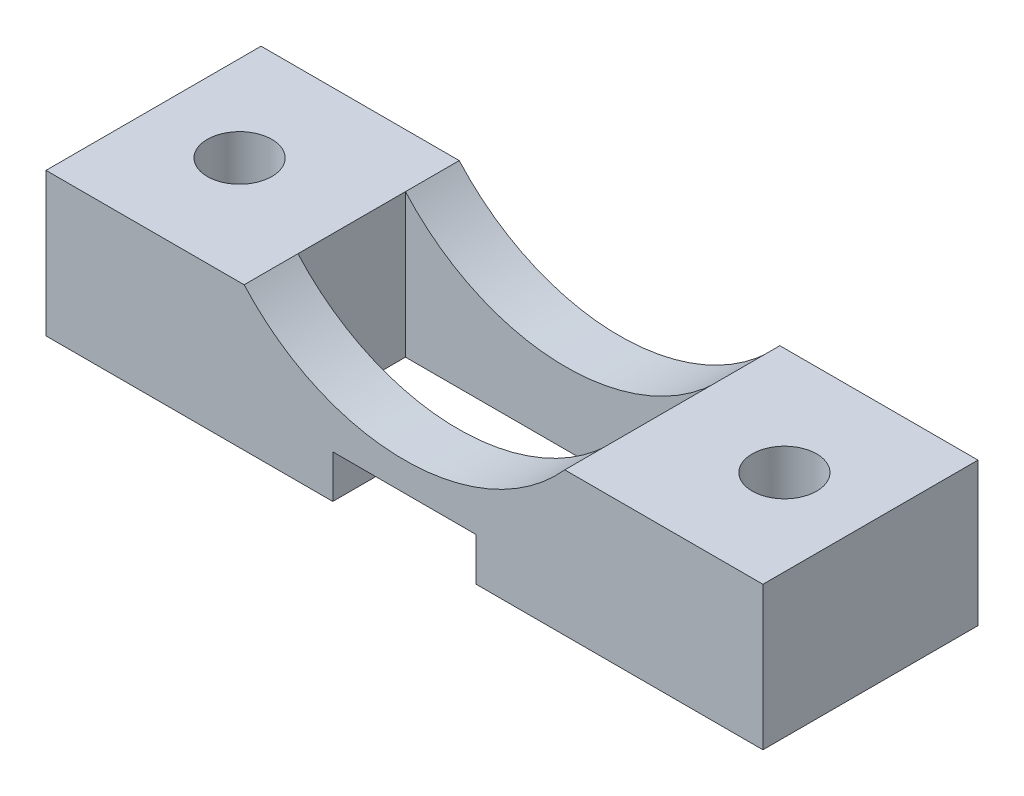
ISO-10303-21;
HEADER;
FILE_DESCRIPTION(('STEP AP214'),'2;1');
FILE_NAME('part.step','',(''),(''),'','','');
FILE_SCHEMA(('AUTOMOTIVE_DESIGN { 1 0 10303 214 1 1 1 1 }'));
ENDSEC;
DATA;
#1=APPLICATION_CONTEXT('core data for automotive mechanical design processes');
#2=APPLICATION_PROTOCOL_DEFINITION('international standard','automotive_design',2000,#1);
#3=PRODUCT_CONTEXT('',#1,'mechanical');
#4=PRODUCT('Part','Part','',(#3));
#5=PRODUCT_RELATED_PRODUCT_CATEGORY('part','',(#4));
#6=PRODUCT_DEFINITION_FORMATION('','',#4);
#7=PRODUCT_DEFINITION_CONTEXT('part definition',#1,'design');
#8=PRODUCT_DEFINITION('design','',#6,#7);
#9=PRODUCT_DEFINITION_SHAPE('','',#8);
#10=(LENGTH_UNIT() NAMED_UNIT(*) SI_UNIT(.MILLI.,.METRE.));
#11=(NAMED_UNIT(*) PLANE_ANGLE_UNIT() SI_UNIT($,.RADIAN.));
#12=(NAMED_UNIT(*) SI_UNIT($,.STERADIAN.) SOLID_ANGLE_UNIT());
#13=UNCERTAINTY_MEASURE_WITH_UNIT(LENGTH_MEASURE(1.E-05),#10,'distance_accuracy_value','');
#14=(GEOMETRIC_REPRESENTATION_CONTEXT(3) GLOBAL_UNCERTAINTY_ASSIGNED_CONTEXT((#13)) GLOBAL_UNIT_ASSIGNED_CONTEXT((#10,
#11,#12)) REPRESENTATION_CONTEXT('',''));
#15=CARTESIAN_POINT('',(0.,0.,0.));
#16=DIRECTION('',(0.,0.,1.));
#17=DIRECTION('',(1.,0.,0.));
#18=AXIS2_PLACEMENT_3D('',#15,#16,#17);
#19=CARTESIAN_POINT('',(0.,15.,15.));
#20=DIRECTION('',(0.,0.,-1.));
#21=DIRECTION('',(-1.,0.,0.));
#22=AXIS2_PLACEMENT_3D('',#19,#20,#21);
#23=CYLINDRICAL_SURFACE('',#22,15.);
#24=DIRECTION('',(0.,0.,-1.));
#25=VECTOR('',#24,1.);
#26=CARTESIAN_POINT('',(-11.180339887499,5.,15.));
#27=LINE('',#26,#25);
#28=CARTESIAN_POINT('',(-11.180339887499,5.,3.75));
#29=VERTEX_POINT('',#28);
#30=CARTESIAN_POINT('',(-11.180339887499,5.,0.));
#31=VERTEX_POINT('',#30);
#32=EDGE_CURVE('E393',#29,#31,#27,.T.);
#33=ORIENTED_EDGE('',*,*,#32,.F.);
#34=CARTESIAN_POINT('',(0.,15.,3.75));
#35=DIRECTION('',(0.,0.,-1.));
#36=DIRECTION('',(-1.,0.,0.));
#37=AXIS2_PLACEMENT_3D('',#34,#35,#36);
#38=CIRCLE('',#37,15.);
#39=CARTESIAN_POINT('',(11.1803398874989,5.,3.75));
#40=VERTEX_POINT('',#39);
#41=EDGE_CURVE('E183',#40,#29,#38,.T.);
#42=ORIENTED_EDGE('',*,*,#41,.F.);
#43=DIRECTION('',(0.,0.,-1.));
#44=VECTOR('',#43,1.);
#45=CARTESIAN_POINT('',(11.1803398874989,5.,15.));
#46=LINE('',#45,#44);
#47=CARTESIAN_POINT('',(11.1803398874989,5.,0.));
#48=VERTEX_POINT('',#47);
#49=EDGE_CURVE('E398',#40,#48,#46,.T.);
#50=ORIENTED_EDGE('',*,*,#49,.T.);
#51=CARTESIAN_POINT('',(0.,15.,0.));
#52=DIRECTION('',(0.,0.,-1.));
#53=DIRECTION('',(1.,0.,0.));
#54=AXIS2_PLACEMENT_3D('',#51,#52,#53);
#55=CIRCLE('',#54,15.);
#56=EDGE_CURVE('E370',#48,#31,#55,.T.);
#57=ORIENTED_EDGE('',*,*,#56,.T.);
#58=EDGE_LOOP('',(#33,#42,#50,#57));
#59=FACE_BOUND('',#58,.T.);
#60=ADVANCED_FACE('F39',(#59),#23,.F.);
#61=CARTESIAN_POINT('',(25.,5.,15.));
#62=DIRECTION('',(-1.,0.,0.));
#63=DIRECTION('',(0.,0.,1.));
#64=AXIS2_PLACEMENT_3D('',#61,#62,#63);
#65=PLANE('',#64);
#66=DIRECTION('',(0.,1.,0.));
#67=VECTOR('',#66,1.);
#68=CARTESIAN_POINT('',(25.,5.,0.));
#69=LINE('',#68,#67);
#70=CARTESIAN_POINT('',(25.,-5.,0.));
#71=VERTEX_POINT('',#70);
#72=CARTESIAN_POINT('',(25.,5.,0.));
#73=VERTEX_POINT('',#72);
#74=EDGE_CURVE('E339',#71,#73,#69,.T.);
#75=ORIENTED_EDGE('',*,*,#74,.T.);
#76=DIRECTION('',(0.,0.,-1.));
#77=VECTOR('',#76,1.);
#78=CARTESIAN_POINT('',(25.,5.,15.));
#79=LINE('',#78,#77);
#80=CARTESIAN_POINT('',(25.,5.,15.));
#81=VERTEX_POINT('',#80);
#82=EDGE_CURVE('E403',#81,#73,#79,.T.);
#83=ORIENTED_EDGE('',*,*,#82,.F.);
#84=DIRECTION('',(0.,1.,0.));
#85=VECTOR('',#84,1.);
#86=CARTESIAN_POINT('',(25.,5.,15.));
#87=LINE('',#86,#85);
#88=CARTESIAN_POINT('',(25.,-5.,15.));
#89=VERTEX_POINT('',#88);
#90=EDGE_CURVE('E340',#89,#81,#87,.T.);
#91=ORIENTED_EDGE('',*,*,#90,.F.);
#92=DIRECTION('',(0.,0.,-1.));
#93=VECTOR('',#92,1.);
#94=CARTESIAN_POINT('',(25.,-5.,15.));
#95=LINE('',#94,#93);
#96=EDGE_CURVE('E362',#89,#71,#95,.T.);
#97=ORIENTED_EDGE('',*,*,#96,.T.);
#98=EDGE_LOOP('',(#75,#83,#91,#97));
#99=FACE_BOUND('',#98,.T.);
#100=ADVANCED_FACE('F649',(#99),#65,.F.);
#101=CARTESIAN_POINT('',(11.1803398874989,5.,15.));
#102=DIRECTION('',(0.,-1.,0.));
#103=DIRECTION('',(0.,0.,-1.));
#104=AXIS2_PLACEMENT_3D('',#101,#102,#103);
#105=PLANE('',#104);
#106=CARTESIAN_POINT('',(19.,5.,7.5));
#107=DIRECTION('',(0.,1.,0.));
#108=DIRECTION('',(0.,0.,-1.));
#109=AXIS2_PLACEMENT_3D('',#106,#107,#108);
#110=CIRCLE('',#109,2.25);
#111=CARTESIAN_POINT('',(19.,5.,5.25));
#112=VERTEX_POINT('',#111);
#113=EDGE_CURVE('E608',#112,#112,#110,.T.);
#114=ORIENTED_EDGE('',*,*,#113,.F.);
#115=EDGE_LOOP('',(#114));
#116=FACE_BOUND('',#115,.T.);
#117=DIRECTION('',(-1.,0.,0.));
#118=VECTOR('',#117,1.);
#119=CARTESIAN_POINT('',(11.1803398874989,5.,0.));
#120=LINE('',#119,#118);
#121=EDGE_CURVE('E366',#73,#48,#120,.T.);
#122=ORIENTED_EDGE('',*,*,#121,.T.);
#123=ORIENTED_EDGE('',*,*,#49,.F.);
#124=DIRECTION('',(0.,0.,-1.));
#125=VECTOR('',#124,1.);
#126=CARTESIAN_POINT('',(11.1803398874989,5.,3.75));
#127=LINE('',#126,#125);
#128=CARTESIAN_POINT('',(11.1803398874989,5.,11.25));
#129=VERTEX_POINT('',#128);
#130=EDGE_CURVE('E319',#129,#40,#127,.T.);
#131=ORIENTED_EDGE('',*,*,#130,.F.);
#132=CARTESIAN_POINT('',(11.1803398874989,5.,15.));
#133=VERTEX_POINT('',#132);
#134=EDGE_CURVE('E399',#133,#129,#46,.T.);
#135=ORIENTED_EDGE('',*,*,#134,.F.);
#136=DIRECTION('',(-1.,0.,0.));
#137=VECTOR('',#136,1.);
#138=CARTESIAN_POINT('',(11.1803398874989,5.,15.));
#139=LINE('',#138,#137);
#140=EDGE_CURVE('E344',#81,#133,#139,.T.);
#141=ORIENTED_EDGE('',*,*,#140,.F.);
#142=ORIENTED_EDGE('',*,*,#82,.T.);
#143=EDGE_LOOP('',(#122,#123,#131,#135,#141,#142));
#144=FACE_BOUND('',#143,.T.);
#145=ADVANCED_FACE('F673',(#116,#144),#105,.F.);
#146=ORIENTED_EDGE('',*,*,#134,.T.);
#147=CARTESIAN_POINT('',(0.,15.,11.25));
#148=DIRECTION('',(0.,0.,1.));
#149=DIRECTION('',(1.,0.,0.));
#150=AXIS2_PLACEMENT_3D('',#147,#148,#149);
#151=CIRCLE('',#150,15.);
#152=CARTESIAN_POINT('',(-11.180339887499,5.,11.25));
#153=VERTEX_POINT('',#152);
#154=EDGE_CURVE('E297',#153,#129,#151,.T.);
#155=ORIENTED_EDGE('',*,*,#154,.F.);
#156=CARTESIAN_POINT('',(-11.180339887499,5.,15.));
#157=VERTEX_POINT('',#156);
#158=EDGE_CURVE('E394',#157,#153,#27,.T.);
#159=ORIENTED_EDGE('',*,*,#158,.F.);
#160=CARTESIAN_POINT('',(0.,15.,15.));
#161=DIRECTION('',(0.,0.,-1.));
#162=DIRECTION('',(1.,0.,0.));
#163=AXIS2_PLACEMENT_3D('',#160,#161,#162);
#164=CIRCLE('',#163,15.);
#165=EDGE_CURVE('E348',#133,#157,#164,.T.);
#166=ORIENTED_EDGE('',*,*,#165,.F.);
#167=EDGE_LOOP('',(#146,#155,#159,#166));
#168=FACE_BOUND('',#167,.T.);
#169=ADVANCED_FACE('F626',(#168),#23,.F.);
#170=CARTESIAN_POINT('',(-25.,5.,15.));
#171=DIRECTION('',(0.,-1.,0.));
#172=DIRECTION('',(0.,0.,-1.));
#173=AXIS2_PLACEMENT_3D('',#170,#171,#172);
#174=PLANE('',#173);
#175=CARTESIAN_POINT('',(-19.,5.,7.5));
#176=DIRECTION('',(0.,1.,0.));
#177=DIRECTION('',(0.,0.,1.));
#178=AXIS2_PLACEMENT_3D('',#175,#176,#177);
#179=CIRCLE('',#178,2.25);
#180=CARTESIAN_POINT('',(-19.,5.,9.75));
#181=VERTEX_POINT('',#180);
#182=EDGE_CURVE('E607',#181,#181,#179,.T.);
#183=ORIENTED_EDGE('',*,*,#182,.F.);
#184=EDGE_LOOP('',(#183));
#185=FACE_BOUND('',#184,.T.);
#186=DIRECTION('',(-1.,0.,0.));
#187=VECTOR('',#186,1.);
#188=CARTESIAN_POINT('',(-25.,5.,0.));
#189=LINE('',#188,#187);
#190=CARTESIAN_POINT('',(-25.,5.,0.));
#191=VERTEX_POINT('',#190);
#192=EDGE_CURVE('E374',#31,#191,#189,.T.);
#193=ORIENTED_EDGE('',*,*,#192,.T.);
#194=DIRECTION('',(0.,0.,-1.));
#195=VECTOR('',#194,1.);
#196=CARTESIAN_POINT('',(-25.,5.,15.));
#197=LINE('',#196,#195);
#198=CARTESIAN_POINT('',(-25.,5.,15.));
#199=VERTEX_POINT('',#198);
#200=EDGE_CURVE('E389',#199,#191,#197,.T.);
#201=ORIENTED_EDGE('',*,*,#200,.F.);
#202=DIRECTION('',(-1.,0.,0.));
#203=VECTOR('',#202,1.);
#204=CARTESIAN_POINT('',(-25.,5.,15.));
#205=LINE('',#204,#203);
#206=EDGE_CURVE('E351',#157,#199,#205,.T.);
#207=ORIENTED_EDGE('',*,*,#206,.F.);
#208=ORIENTED_EDGE('',*,*,#158,.T.);
#209=DIRECTION('',(0.,0.,1.));
#210=VECTOR('',#209,1.);
#211=CARTESIAN_POINT('',(-11.180339887499,5.,3.75));
#212=LINE('',#211,#210);
#213=EDGE_CURVE('E315',#29,#153,#212,.T.);
#214=ORIENTED_EDGE('',*,*,#213,.F.);
#215=ORIENTED_EDGE('',*,*,#32,.T.);
#216=EDGE_LOOP('',(#193,#201,#207,#208,#214,#215));
#217=FACE_BOUND('',#216,.T.);
#218=ADVANCED_FACE('F622',(#185,#217),#174,.F.);
#219=CARTESIAN_POINT('',(-25.,5.,15.));
#220=DIRECTION('',(1.,0.,0.));
#221=DIRECTION('',(0.,0.,-1.));
#222=AXIS2_PLACEMENT_3D('',#219,#220,#221);
#223=PLANE('',#222);
#224=DIRECTION('',(0.,-1.,0.));
#225=VECTOR('',#224,1.);
#226=CARTESIAN_POINT('',(-25.,5.,0.));
#227=LINE('',#226,#225);
#228=CARTESIAN_POINT('',(-25.,-5.,0.));
#229=VERTEX_POINT('',#228);
#230=EDGE_CURVE('E377',#191,#229,#227,.T.);
#231=ORIENTED_EDGE('',*,*,#230,.T.);
#232=DIRECTION('',(0.,0.,-1.));
#233=VECTOR('',#232,1.);
#234=CARTESIAN_POINT('',(-25.,-5.,15.));
#235=LINE('',#234,#233);
#236=CARTESIAN_POINT('',(-25.,-5.,15.));
#237=VERTEX_POINT('',#236);
#238=EDGE_CURVE('E385',#237,#229,#235,.T.);
#239=ORIENTED_EDGE('',*,*,#238,.F.);
#240=DIRECTION('',(0.,-1.,0.));
#241=VECTOR('',#240,1.);
#242=CARTESIAN_POINT('',(-25.,5.,15.));
#243=LINE('',#242,#241);
#244=EDGE_CURVE('E354',#199,#237,#243,.T.);
#245=ORIENTED_EDGE('',*,*,#244,.F.);
#246=ORIENTED_EDGE('',*,*,#200,.T.);
#247=EDGE_LOOP('',(#231,#239,#245,#246));
#248=FACE_BOUND('',#247,.T.);
#249=ADVANCED_FACE('F625',(#248),#223,.F.);
#250=CARTESIAN_POINT('',(-25.,-5.,15.));
#251=DIRECTION('',(0.,1.,0.));
#252=DIRECTION('',(0.,0.,1.));
#253=AXIS2_PLACEMENT_3D('',#250,#251,#252);
#254=PLANE('',#253);
#255=CARTESIAN_POINT('',(-19.,-5.,7.5));
#256=DIRECTION('',(0.,1.,0.));
#257=DIRECTION('',(0.,0.,1.));
#258=AXIS2_PLACEMENT_3D('',#255,#256,#257);
#259=CIRCLE('',#258,2.25);
#260=CARTESIAN_POINT('',(-19.,-5.,9.75));
#261=VERTEX_POINT('',#260);
#262=EDGE_CURVE('E278',#261,#261,#259,.F.);
#263=ORIENTED_EDGE('',*,*,#262,.F.);
#264=EDGE_LOOP('',(#263));
#265=FACE_BOUND('',#264,.T.);
#266=CARTESIAN_POINT('',(19.,-5.,7.5));
#267=DIRECTION('',(0.,1.,0.));
#268=DIRECTION('',(0.,0.,1.));
#269=AXIS2_PLACEMENT_3D('',#266,#267,#268);
#270=CIRCLE('',#269,2.25);
#271=CARTESIAN_POINT('',(19.,-5.,9.75));
#272=VERTEX_POINT('',#271);
#273=EDGE_CURVE('E603',#272,#272,#270,.F.);
#274=ORIENTED_EDGE('',*,*,#273,.F.);
#275=EDGE_LOOP('',(#274));
#276=FACE_BOUND('',#275,.T.);
#277=DIRECTION('',(1.,0.,0.));
#278=VECTOR('',#277,1.);
#279=CARTESIAN_POINT('',(-25.,-5.,15.));
#280=LINE('',#279,#278);
#281=CARTESIAN_POINT('',(5.,-5.,15.));
#282=VERTEX_POINT('',#281);
#283=EDGE_CURVE('E357',#282,#89,#280,.T.);
#284=ORIENTED_EDGE('',*,*,#283,.F.);
#285=DIRECTION('',(0.,0.,1.));
#286=VECTOR('',#285,1.);
#287=CARTESIAN_POINT('',(5.,-5.,-0.000999999999999265));
#288=LINE('',#287,#286);
#289=CARTESIAN_POINT('',(5.,-5.,11.25));
#290=VERTEX_POINT('',#289);
#291=EDGE_CURVE('E292',#290,#282,#288,.T.);
#292=ORIENTED_EDGE('',*,*,#291,.F.);
#293=DIRECTION('',(-1.,0.,0.));
#294=VECTOR('',#293,1.);
#295=CARTESIAN_POINT('',(11.1803398874989,-5.,11.25));
#296=LINE('',#295,#294);
#297=CARTESIAN_POINT('',(11.1803398874989,-5.,11.25));
#298=VERTEX_POINT('',#297);
#299=EDGE_CURVE('E304',#298,#290,#296,.T.);
#300=ORIENTED_EDGE('',*,*,#299,.F.);
#301=DIRECTION('',(0.,0.,1.));
#302=VECTOR('',#301,1.);
#303=CARTESIAN_POINT('',(11.1803398874989,-5.,3.75));
#304=LINE('',#303,#302);
#305=CARTESIAN_POINT('',(11.1803398874989,-5.,3.75));
#306=VERTEX_POINT('',#305);
#307=EDGE_CURVE('E307',#306,#298,#304,.T.);
#308=ORIENTED_EDGE('',*,*,#307,.F.);
#309=DIRECTION('',(1.,0.,0.));
#310=VECTOR('',#309,1.);
#311=CARTESIAN_POINT('',(-11.180339887499,-5.,3.75));
#312=LINE('',#311,#310);
#313=CARTESIAN_POINT('',(-11.180339887499,-5.,3.75));
#314=VERTEX_POINT('',#313);
#315=EDGE_CURVE('E311',#314,#306,#312,.T.);
#316=ORIENTED_EDGE('',*,*,#315,.F.);
#317=DIRECTION('',(0.,0.,-1.));
#318=VECTOR('',#317,1.);
#319=CARTESIAN_POINT('',(-11.180339887499,-5.,3.75));
#320=LINE('',#319,#318);
#321=CARTESIAN_POINT('',(-11.180339887499,-5.,11.25));
#322=VERTEX_POINT('',#321);
#323=EDGE_CURVE('E327',#322,#314,#320,.T.);
#324=ORIENTED_EDGE('',*,*,#323,.F.);
#325=CARTESIAN_POINT('',(-5.,-5.,11.25));
#326=VERTEX_POINT('',#325);
#327=EDGE_CURVE('E303',#326,#322,#296,.T.);
#328=ORIENTED_EDGE('',*,*,#327,.F.);
#329=DIRECTION('',(0.,0.,1.));
#330=VECTOR('',#329,1.);
#331=CARTESIAN_POINT('',(-5.,-5.,-0.000999999999999265));
#332=LINE('',#331,#330);
#333=CARTESIAN_POINT('',(-5.,-5.,15.));
#334=VERTEX_POINT('',#333);
#335=EDGE_CURVE('E175',#326,#334,#332,.T.);
#336=ORIENTED_EDGE('',*,*,#335,.T.);
#337=EDGE_CURVE('E358',#237,#334,#280,.T.);
#338=ORIENTED_EDGE('',*,*,#337,.F.);
#339=ORIENTED_EDGE('',*,*,#238,.T.);
#340=DIRECTION('',(1.,0.,0.));
#341=VECTOR('',#340,1.);
#342=CARTESIAN_POINT('',(-25.,-5.,0.));
#343=LINE('',#342,#341);
#344=EDGE_CURVE('E345',#229,#71,#343,.T.);
#345=ORIENTED_EDGE('',*,*,#344,.T.);
#346=ORIENTED_EDGE('',*,*,#96,.F.);
#347=EDGE_LOOP('',(#284,#292,#300,#308,#316,#324,#328,#336,#338,#339,#345,#346));
#348=FACE_BOUND('',#347,.T.);
#349=ADVANCED_FACE('F645',(#265,#276,#348),#254,.F.);
#350=CARTESIAN_POINT('',(0.,15.,15.));
#351=DIRECTION('',(0.,0.,1.));
#352=DIRECTION('',(1.,0.,0.));
#353=AXIS2_PLACEMENT_3D('',#350,#351,#352);
#354=PLANE('',#353);
#355=DIRECTION('',(0.,1.,0.));
#356=VECTOR('',#355,1.);
#357=CARTESIAN_POINT('',(5.,-2.,15.));
#358=LINE('',#357,#356);
#359=CARTESIAN_POINT('',(5.,-2.,15.));
#360=VERTEX_POINT('',#359);
#361=EDGE_CURVE('E597',#282,#360,#358,.T.);
#362=ORIENTED_EDGE('',*,*,#361,.F.);
#363=ORIENTED_EDGE('',*,*,#283,.T.);
#364=ORIENTED_EDGE('',*,*,#90,.T.);
#365=ORIENTED_EDGE('',*,*,#140,.T.);
#366=ORIENTED_EDGE('',*,*,#165,.T.);
#367=ORIENTED_EDGE('',*,*,#206,.T.);
#368=ORIENTED_EDGE('',*,*,#244,.T.);
#369=ORIENTED_EDGE('',*,*,#337,.T.);
#370=DIRECTION('',(0.,-1.,0.));
#371=VECTOR('',#370,1.);
#372=CARTESIAN_POINT('',(-5.,-5.,15.));
#373=LINE('',#372,#371);
#374=CARTESIAN_POINT('',(-5.,-2.,15.));
#375=VERTEX_POINT('',#374);
#376=EDGE_CURVE('E286',#375,#334,#373,.T.);
#377=ORIENTED_EDGE('',*,*,#376,.F.);
#378=DIRECTION('',(-1.,0.,0.));
#379=VECTOR('',#378,1.);
#380=CARTESIAN_POINT('',(-5.,-2.,15.));
#381=LINE('',#380,#379);
#382=EDGE_CURVE('E268',#360,#375,#381,.T.);
#383=ORIENTED_EDGE('',*,*,#382,.F.);
#384=EDGE_LOOP('',(#362,#363,#364,#365,#366,#367,#368,#369,#377,#383));
#385=FACE_BOUND('',#384,.T.);
#386=ADVANCED_FACE('F653',(#385),#354,.T.);
#387=CARTESIAN_POINT('',(0.,15.,0.));
#388=DIRECTION('',(0.,0.,1.));
#389=DIRECTION('',(1.,0.,0.));
#390=AXIS2_PLACEMENT_3D('',#387,#388,#389);
#391=PLANE('',#390);
#392=ORIENTED_EDGE('',*,*,#74,.F.);
#393=ORIENTED_EDGE('',*,*,#344,.F.);
#394=ORIENTED_EDGE('',*,*,#230,.F.);
#395=ORIENTED_EDGE('',*,*,#192,.F.);
#396=ORIENTED_EDGE('',*,*,#56,.F.);
#397=ORIENTED_EDGE('',*,*,#121,.F.);
#398=EDGE_LOOP('',(#392,#393,#394,#395,#396,#397));
#399=FACE_BOUND('',#398,.T.);
#400=ADVANCED_FACE('F641',(#399),#391,.F.);
#401=CARTESIAN_POINT('',(-11.180339887499,-5.001,3.75));
#402=DIRECTION('',(0.,0.,-1.));
#403=DIRECTION('',(-1.,0.,0.));
#404=AXIS2_PLACEMENT_3D('',#401,#402,#403);
#405=PLANE('',#404);
#406=ORIENTED_EDGE('',*,*,#41,.T.);
#407=DIRECTION('',(0.,1.,0.));
#408=VECTOR('',#407,1.);
#409=CARTESIAN_POINT('',(-11.180339887499,-5.001,3.75));
#410=LINE('',#409,#408);
#411=EDGE_CURVE('E323',#314,#29,#410,.T.);
#412=ORIENTED_EDGE('',*,*,#411,.F.);
#413=ORIENTED_EDGE('',*,*,#315,.T.);
#414=DIRECTION('',(0.,1.,0.));
#415=VECTOR('',#414,1.);
#416=CARTESIAN_POINT('',(11.1803398874989,-5.001,3.75));
#417=LINE('',#416,#415);
#418=EDGE_CURVE('E324',#306,#40,#417,.T.);
#419=ORIENTED_EDGE('',*,*,#418,.T.);
#420=EDGE_LOOP('',(#406,#412,#413,#419));
#421=FACE_BOUND('',#420,.T.);
#422=ADVANCED_FACE('F665',(#421),#405,.F.);
#423=CARTESIAN_POINT('',(11.1803398874989,-5.001,3.75));
#424=DIRECTION('',(1.,0.,0.));
#425=DIRECTION('',(0.,0.,-1.));
#426=AXIS2_PLACEMENT_3D('',#423,#424,#425);
#427=PLANE('',#426);
#428=ORIENTED_EDGE('',*,*,#307,.T.);
#429=DIRECTION('',(0.,1.,0.));
#430=VECTOR('',#429,1.);
#431=CARTESIAN_POINT('',(11.1803398874989,-5.001,11.25));
#432=LINE('',#431,#430);
#433=EDGE_CURVE('E328',#298,#129,#432,.T.);
#434=ORIENTED_EDGE('',*,*,#433,.T.);
#435=ORIENTED_EDGE('',*,*,#130,.T.);
#436=ORIENTED_EDGE('',*,*,#418,.F.);
#437=EDGE_LOOP('',(#428,#434,#435,#436));
#438=FACE_BOUND('',#437,.T.);
#439=ADVANCED_FACE('F662',(#438),#427,.F.);
#440=CARTESIAN_POINT('',(11.1803398874989,-5.001,11.25));
#441=DIRECTION('',(0.,0.,1.));
#442=DIRECTION('',(1.,0.,0.));
#443=AXIS2_PLACEMENT_3D('',#440,#441,#442);
#444=PLANE('',#443);
#445=ORIENTED_EDGE('',*,*,#299,.T.);
#446=DIRECTION('',(0.,-1.,0.));
#447=VECTOR('',#446,1.);
#448=CARTESIAN_POINT('',(5.,-2.,11.25));
#449=LINE('',#448,#447);
#450=CARTESIAN_POINT('',(5.,-2.,11.25));
#451=VERTEX_POINT('',#450);
#452=EDGE_CURVE('E282',#451,#290,#449,.T.);
#453=ORIENTED_EDGE('',*,*,#452,.F.);
#454=DIRECTION('',(1.,0.,0.));
#455=VECTOR('',#454,1.);
#456=CARTESIAN_POINT('',(-5.,-2.,11.25));
#457=LINE('',#456,#455);
#458=CARTESIAN_POINT('',(-5.,-2.,11.25));
#459=VERTEX_POINT('',#458);
#460=EDGE_CURVE('E265',#459,#451,#457,.T.);
#461=ORIENTED_EDGE('',*,*,#460,.F.);
#462=DIRECTION('',(0.,1.,0.));
#463=VECTOR('',#462,1.);
#464=CARTESIAN_POINT('',(-5.,-5.,11.25));
#465=LINE('',#464,#463);
#466=EDGE_CURVE('E273',#326,#459,#465,.T.);
#467=ORIENTED_EDGE('',*,*,#466,.F.);
#468=ORIENTED_EDGE('',*,*,#327,.T.);
#469=DIRECTION('',(0.,1.,0.));
#470=VECTOR('',#469,1.);
#471=CARTESIAN_POINT('',(-11.180339887499,-5.001,11.25));
#472=LINE('',#471,#470);
#473=EDGE_CURVE('E331',#322,#153,#472,.T.);
#474=ORIENTED_EDGE('',*,*,#473,.T.);
#475=ORIENTED_EDGE('',*,*,#154,.T.);
#476=ORIENTED_EDGE('',*,*,#433,.F.);
#477=EDGE_LOOP('',(#445,#453,#461,#467,#468,#474,#475,#476));
#478=FACE_BOUND('',#477,.T.);
#479=ADVANCED_FACE('F281',(#478),#444,.F.);
#480=CARTESIAN_POINT('',(-11.180339887499,-5.001,3.75));
#481=DIRECTION('',(-1.,0.,0.));
#482=DIRECTION('',(0.,0.,1.));
#483=AXIS2_PLACEMENT_3D('',#480,#481,#482);
#484=PLANE('',#483);
#485=ORIENTED_EDGE('',*,*,#323,.T.);
#486=ORIENTED_EDGE('',*,*,#411,.T.);
#487=ORIENTED_EDGE('',*,*,#213,.T.);
#488=ORIENTED_EDGE('',*,*,#473,.F.);
#489=EDGE_LOOP('',(#485,#486,#487,#488));
#490=FACE_BOUND('',#489,.T.);
#491=ADVANCED_FACE('F668',(#490),#484,.F.);
#492=CARTESIAN_POINT('',(5.,-2.,-0.000999999999999265));
#493=DIRECTION('',(1.,0.,0.));
#494=DIRECTION('',(0.,1.,0.));
#495=AXIS2_PLACEMENT_3D('',#492,#493,#494);
#496=PLANE('',#495);
#497=ORIENTED_EDGE('',*,*,#452,.T.);
#498=ORIENTED_EDGE('',*,*,#291,.T.);
#499=ORIENTED_EDGE('',*,*,#361,.T.);
#500=DIRECTION('',(0.,0.,1.));
#501=VECTOR('',#500,1.);
#502=CARTESIAN_POINT('',(5.,-2.,-0.000999999999999265));
#503=LINE('',#502,#501);
#504=EDGE_CURVE('E271',#451,#360,#503,.T.);
#505=ORIENTED_EDGE('',*,*,#504,.F.);
#506=EDGE_LOOP('',(#497,#498,#499,#505));
#507=FACE_BOUND('',#506,.T.);
#508=ADVANCED_FACE('F948',(#507),#496,.F.);
#509=CARTESIAN_POINT('',(-5.,-2.,-0.000999999999999265));
#510=DIRECTION('',(0.,1.,0.));
#511=DIRECTION('',(0.,0.,1.));
#512=AXIS2_PLACEMENT_3D('',#509,#510,#511);
#513=PLANE('',#512);
#514=ORIENTED_EDGE('',*,*,#460,.T.);
#515=ORIENTED_EDGE('',*,*,#504,.T.);
#516=ORIENTED_EDGE('',*,*,#382,.T.);
#517=DIRECTION('',(0.,0.,1.));
#518=VECTOR('',#517,1.);
#519=CARTESIAN_POINT('',(-5.,-2.,-0.000999999999999265));
#520=LINE('',#519,#518);
#521=EDGE_CURVE('E262',#459,#375,#520,.T.);
#522=ORIENTED_EDGE('',*,*,#521,.F.);
#523=EDGE_LOOP('',(#514,#515,#516,#522));
#524=FACE_BOUND('',#523,.T.);
#525=ADVANCED_FACE('F263',(#524),#513,.F.);
#526=CARTESIAN_POINT('',(-5.,-5.,-0.000999999999999265));
#527=DIRECTION('',(-1.,0.,0.));
#528=DIRECTION('',(0.,0.,1.));
#529=AXIS2_PLACEMENT_3D('',#526,#527,#528);
#530=PLANE('',#529);
#531=ORIENTED_EDGE('',*,*,#466,.T.);
#532=ORIENTED_EDGE('',*,*,#521,.T.);
#533=ORIENTED_EDGE('',*,*,#376,.T.);
#534=ORIENTED_EDGE('',*,*,#335,.F.);
#535=EDGE_LOOP('',(#531,#532,#533,#534));
#536=FACE_BOUND('',#535,.T.);
#537=ADVANCED_FACE('F274',(#536),#530,.F.);
#538=CARTESIAN_POINT('',(19.,-5.001,7.5));
#539=DIRECTION('',(0.,1.,0.));
#540=DIRECTION('',(0.,0.,1.));
#541=AXIS2_PLACEMENT_3D('',#538,#539,#540);
#542=CYLINDRICAL_SURFACE('',#541,2.25);
#543=ORIENTED_EDGE('',*,*,#113,.T.);
#544=EDGE_LOOP('',(#543));
#545=FACE_BOUND('',#544,.T.);
#546=ORIENTED_EDGE('',*,*,#273,.T.);
#547=EDGE_LOOP('',(#546));
#548=FACE_BOUND('',#547,.T.);
#549=ADVANCED_FACE('F924',(#545,#548),#542,.F.);
#550=CARTESIAN_POINT('',(-19.,-5.001,7.5));
#551=DIRECTION('',(0.,1.,0.));
#552=DIRECTION('',(0.,0.,1.));
#553=AXIS2_PLACEMENT_3D('',#550,#551,#552);
#554=CYLINDRICAL_SURFACE('',#553,2.25);
#555=ORIENTED_EDGE('',*,*,#182,.T.);
#556=EDGE_LOOP('',(#555));
#557=FACE_BOUND('',#556,.T.);
#558=ORIENTED_EDGE('',*,*,#262,.T.);
#559=EDGE_LOOP('',(#558));
#560=FACE_BOUND('',#559,.T.);
#561=ADVANCED_FACE('F619',(#557,#560),#554,.F.);
#562=CLOSED_SHELL('',(#60,#100,#145,#169,#218,#249,#349,#386,#400,#422,#439,#479,#491,#508,#525,
#537,#549,#561));
#563=CARTESIAN_POINT('',(11.1803398874989,-5.001,12.25));
#564=DIRECTION('',(0.,0.,1.));
#565=DIRECTION('',(1.,0.,0.));
#566=AXIS2_PLACEMENT_3D('',#563,#564,#565);
#567=PLANE('',#566);
#568=DIRECTION('',(1.,0.,0.));
#569=VECTOR('',#568,1.);
#570=CARTESIAN_POINT('',(-5.,-0.999999999999999,12.25));
#571=LINE('',#570,#569);
#572=CARTESIAN_POINT('',(0.,-0.999999999999997,12.25));
#573=VERTEX_POINT('',#572);
#574=CARTESIAN_POINT('',(6.,-0.999999999999999,12.25));
#575=VERTEX_POINT('',#574);
#576=EDGE_CURVE('E167',#573,#575,#571,.T.);
#577=ORIENTED_EDGE('',*,*,#576,.T.);
#578=DIRECTION('',(0.,-1.,0.));
#579=VECTOR('',#578,1.);
#580=CARTESIAN_POINT('',(6.,-2.,12.25));
#581=LINE('',#580,#579);
#582=CARTESIAN_POINT('',(6.,-4.,12.25));
#583=VERTEX_POINT('',#582);
#584=EDGE_CURVE('E447',#575,#583,#581,.T.);
#585=ORIENTED_EDGE('',*,*,#584,.T.);
#586=DIRECTION('',(-1.,0.,0.));
#587=VECTOR('',#586,1.);
#588=CARTESIAN_POINT('',(11.1803398874989,-4.,12.25));
#589=LINE('',#588,#587);
#590=CARTESIAN_POINT('',(12.1803398874989,-4.,12.25));
#591=VERTEX_POINT('',#590);
#592=EDGE_CURVE('E582',#591,#583,#589,.T.);
#593=ORIENTED_EDGE('',*,*,#592,.F.);
#594=DIRECTION('',(0.,1.,0.));
#595=VECTOR('',#594,1.);
#596=CARTESIAN_POINT('',(12.1803398874989,-5.001,12.25));
#597=LINE('',#596,#595);
#598=CARTESIAN_POINT('',(12.1803398874989,4.,12.25));
#599=VERTEX_POINT('',#598);
#600=EDGE_CURVE('E475',#591,#599,#597,.T.);
#601=ORIENTED_EDGE('',*,*,#600,.T.);
#602=DIRECTION('',(1.,0.,0.));
#603=VECTOR('',#602,1.);
#604=CARTESIAN_POINT('',(11.1803398874989,4.,12.25));
#605=LINE('',#604,#603);
#606=CARTESIAN_POINT('',(11.6189500386222,4.,12.25));
#607=VERTEX_POINT('',#606);
#608=EDGE_CURVE('E43',#607,#599,#605,.T.);
#609=ORIENTED_EDGE('',*,*,#608,.F.);
#610=CARTESIAN_POINT('',(0.,15.,12.25));
#611=DIRECTION('',(0.,0.,1.));
#612=DIRECTION('',(1.,0.,0.));
#613=AXIS2_PLACEMENT_3D('',#610,#611,#612);
#614=CIRCLE('',#613,16.);
#615=EDGE_CURVE('E162',#573,#607,#614,.T.);
#616=ORIENTED_EDGE('',*,*,#615,.F.);
#617=EDGE_LOOP('',(#577,#585,#593,#601,#609,#616));
#618=FACE_BOUND('',#617,.T.);
#619=ADVANCED_FACE('F698',(#618),#567,.T.);
#620=CARTESIAN_POINT('',(0.,15.,14.));
#621=DIRECTION('',(0.,0.,1.));
#622=DIRECTION('',(1.,0.,0.));
#623=AXIS2_PLACEMENT_3D('',#620,#621,#622);
#624=PLANE('',#623);
#625=DIRECTION('',(-1.,0.,0.));
#626=VECTOR('',#625,1.);
#627=CARTESIAN_POINT('',(0.,-0.999999999999997,14.));
#628=LINE('',#627,#626);
#629=CARTESIAN_POINT('',(0.,-0.999999999999997,14.));
#630=VERTEX_POINT('',#629);
#631=CARTESIAN_POINT('',(-6.,-0.999999999999999,14.));
#632=VERTEX_POINT('',#631);
#633=EDGE_CURVE('E435',#630,#632,#628,.T.);
#634=ORIENTED_EDGE('',*,*,#633,.T.);
#635=DIRECTION('',(0.,-1.,0.));
#636=VECTOR('',#635,1.);
#637=CARTESIAN_POINT('',(-6.,15.,14.));
#638=LINE('',#637,#636);
#639=CARTESIAN_POINT('',(-6.,-4.,14.));
#640=VERTEX_POINT('',#639);
#641=EDGE_CURVE('E418',#632,#640,#638,.T.);
#642=ORIENTED_EDGE('',*,*,#641,.T.);
#643=DIRECTION('',(1.,0.,0.));
#644=VECTOR('',#643,1.);
#645=CARTESIAN_POINT('',(-25.,-4.,14.));
#646=LINE('',#645,#644);
#647=CARTESIAN_POINT('',(-24.,-4.,14.));
#648=VERTEX_POINT('',#647);
#649=EDGE_CURVE('E574',#648,#640,#646,.T.);
#650=ORIENTED_EDGE('',*,*,#649,.F.);
#651=DIRECTION('',(0.,-1.,0.));
#652=VECTOR('',#651,1.);
#653=CARTESIAN_POINT('',(-24.,5.,14.));
#654=LINE('',#653,#652);
#655=CARTESIAN_POINT('',(-24.,4.,14.));
#656=VERTEX_POINT('',#655);
#657=EDGE_CURVE('E577',#656,#648,#654,.T.);
#658=ORIENTED_EDGE('',*,*,#657,.F.);
#659=DIRECTION('',(-1.,0.,0.));
#660=VECTOR('',#659,1.);
#661=CARTESIAN_POINT('',(-25.,4.,14.));
#662=LINE('',#661,#660);
#663=CARTESIAN_POINT('',(-11.6189500386223,4.,14.));
#664=VERTEX_POINT('',#663);
#665=EDGE_CURVE('E580',#664,#656,#662,.T.);
#666=ORIENTED_EDGE('',*,*,#665,.F.);
#667=CARTESIAN_POINT('',(0.,15.,14.));
#668=DIRECTION('',(0.,0.,1.));
#669=DIRECTION('',(1.,0.,0.));
#670=AXIS2_PLACEMENT_3D('',#667,#668,#669);
#671=CIRCLE('',#670,16.);
#672=EDGE_CURVE('E503',#630,#664,#671,.F.);
#673=ORIENTED_EDGE('',*,*,#672,.F.);
#674=EDGE_LOOP('',(#634,#642,#650,#658,#666,#673));
#675=FACE_BOUND('',#674,.T.);
#676=ADVANCED_FACE('F706',(#675),#624,.F.);
#677=CARTESIAN_POINT('',(0.,15.,15.));
#678=DIRECTION('',(0.,0.,-1.));
#679=DIRECTION('',(-1.,0.,0.));
#680=AXIS2_PLACEMENT_3D('',#677,#678,#679);
#681=CYLINDRICAL_SURFACE('',#680,16.);
#682=DIRECTION('',(0.,0.,-1.));
#683=VECTOR('',#682,1.);
#684=CARTESIAN_POINT('',(-11.6189500386223,4.,15.));
#685=LINE('',#684,#683);
#686=CARTESIAN_POINT('',(-11.6189500386223,4.,2.75));
#687=VERTEX_POINT('',#686);
#688=CARTESIAN_POINT('',(-11.6189500386223,4.,1.));
#689=VERTEX_POINT('',#688);
#690=EDGE_CURVE('E529',#687,#689,#685,.T.);
#691=ORIENTED_EDGE('',*,*,#690,.T.);
#692=CARTESIAN_POINT('',(0.,15.,1.));
#693=DIRECTION('',(0.,0.,1.));
#694=DIRECTION('',(1.,0.,0.));
#695=AXIS2_PLACEMENT_3D('',#692,#693,#694);
#696=CIRCLE('',#695,16.);
#697=CARTESIAN_POINT('',(11.6189500386223,4.,1.));
#698=VERTEX_POINT('',#697);
#699=EDGE_CURVE('E567',#698,#689,#696,.F.);
#700=ORIENTED_EDGE('',*,*,#699,.F.);
#701=DIRECTION('',(0.,0.,-1.));
#702=VECTOR('',#701,1.);
#703=CARTESIAN_POINT('',(11.6189500386222,4.,15.));
#704=LINE('',#703,#702);
#705=CARTESIAN_POINT('',(11.6189500386222,4.,2.75));
#706=VERTEX_POINT('',#705);
#707=EDGE_CURVE('E571',#706,#698,#704,.T.);
#708=ORIENTED_EDGE('',*,*,#707,.F.);
#709=CARTESIAN_POINT('',(0.,15.,2.75));
#710=DIRECTION('',(0.,0.,-1.));
#711=DIRECTION('',(-1.,0.,0.));
#712=AXIS2_PLACEMENT_3D('',#709,#710,#711);
#713=CIRCLE('',#712,16.);
#714=EDGE_CURVE('E494',#706,#687,#713,.T.);
#715=ORIENTED_EDGE('',*,*,#714,.T.);
#716=EDGE_LOOP('',(#691,#700,#708,#715));
#717=FACE_BOUND('',#716,.T.);
#718=ADVANCED_FACE('F707',(#717),#681,.T.);
#719=CARTESIAN_POINT('',(24.,5.,15.));
#720=DIRECTION('',(-1.,0.,0.));
#721=DIRECTION('',(0.,0.,1.));
#722=AXIS2_PLACEMENT_3D('',#719,#720,#721);
#723=PLANE('',#722);
#724=DIRECTION('',(0.,1.,0.));
#725=VECTOR('',#724,1.);
#726=CARTESIAN_POINT('',(24.,5.,1.));
#727=LINE('',#726,#725);
#728=CARTESIAN_POINT('',(24.,-4.,1.));
#729=VERTEX_POINT('',#728);
#730=CARTESIAN_POINT('',(24.,4.,1.));
#731=VERTEX_POINT('',#730);
#732=EDGE_CURVE('E563',#729,#731,#727,.T.);
#733=ORIENTED_EDGE('',*,*,#732,.F.);
#734=DIRECTION('',(0.,0.,-1.));
#735=VECTOR('',#734,1.);
#736=CARTESIAN_POINT('',(24.,-4.,15.));
#737=LINE('',#736,#735);
#738=CARTESIAN_POINT('',(24.,-4.,14.));
#739=VERTEX_POINT('',#738);
#740=EDGE_CURVE('E559',#739,#729,#737,.T.);
#741=ORIENTED_EDGE('',*,*,#740,.F.);
#742=DIRECTION('',(0.,1.,0.));
#743=VECTOR('',#742,1.);
#744=CARTESIAN_POINT('',(24.,5.,14.));
#745=LINE('',#744,#743);
#746=CARTESIAN_POINT('',(24.,4.,14.));
#747=VERTEX_POINT('',#746);
#748=EDGE_CURVE('E506',#739,#747,#745,.T.);
#749=ORIENTED_EDGE('',*,*,#748,.T.);
#750=DIRECTION('',(0.,0.,-1.));
#751=VECTOR('',#750,1.);
#752=CARTESIAN_POINT('',(24.,4.,15.));
#753=LINE('',#752,#751);
#754=EDGE_CURVE('E547',#747,#731,#753,.T.);
#755=ORIENTED_EDGE('',*,*,#754,.T.);
#756=EDGE_LOOP('',(#733,#741,#749,#755));
#757=FACE_BOUND('',#756,.T.);
#758=ADVANCED_FACE('F710',(#757),#723,.T.);
#759=CARTESIAN_POINT('',(11.1803398874989,4.,15.));
#760=DIRECTION('',(0.,-1.,0.));
#761=DIRECTION('',(0.,0.,-1.));
#762=AXIS2_PLACEMENT_3D('',#759,#760,#761);
#763=PLANE('',#762);
#764=CARTESIAN_POINT('',(19.,4.,7.5));
#765=DIRECTION('',(0.,-1.,0.));
#766=DIRECTION('',(0.,0.,-1.));
#767=AXIS2_PLACEMENT_3D('',#764,#765,#766);
#768=CIRCLE('',#767,3.25);
#769=CARTESIAN_POINT('',(19.,4.,4.25));
#770=VERTEX_POINT('',#769);
#771=EDGE_CURVE('E414',#770,#770,#768,.F.);
#772=ORIENTED_EDGE('',*,*,#771,.T.);
#773=EDGE_LOOP('',(#772));
#774=FACE_BOUND('',#773,.T.);
#775=DIRECTION('',(-1.,0.,0.));
#776=VECTOR('',#775,1.);
#777=CARTESIAN_POINT('',(11.1803398874989,4.,1.));
#778=LINE('',#777,#776);
#779=EDGE_CURVE('E555',#731,#698,#778,.T.);
#780=ORIENTED_EDGE('',*,*,#779,.F.);
#781=ORIENTED_EDGE('',*,*,#754,.F.);
#782=DIRECTION('',(-1.,0.,0.));
#783=VECTOR('',#782,1.);
#784=CARTESIAN_POINT('',(11.1803398874989,4.,14.));
#785=LINE('',#784,#783);
#786=CARTESIAN_POINT('',(11.6189500386223,4.,14.));
#787=VERTEX_POINT('',#786);
#788=EDGE_CURVE('E502',#747,#787,#785,.T.);
#789=ORIENTED_EDGE('',*,*,#788,.T.);
#790=DIRECTION('',(0.,0.,-1.));
#791=VECTOR('',#790,1.);
#792=CARTESIAN_POINT('',(11.6189500386222,4.,15.));
#793=LINE('',#792,#791);
#794=EDGE_CURVE('E543',#787,#607,#793,.T.);
#795=ORIENTED_EDGE('',*,*,#794,.T.);
#796=ORIENTED_EDGE('',*,*,#608,.T.);
#797=DIRECTION('',(0.,0.,-1.));
#798=VECTOR('',#797,1.);
#799=CARTESIAN_POINT('',(12.1803398874989,4.,3.75));
#800=LINE('',#799,#798);
#801=CARTESIAN_POINT('',(12.1803398874989,4.,2.75));
#802=VERTEX_POINT('',#801);
#803=EDGE_CURVE('E471',#599,#802,#800,.T.);
#804=ORIENTED_EDGE('',*,*,#803,.T.);
#805=DIRECTION('',(1.,0.,0.));
#806=VECTOR('',#805,1.);
#807=CARTESIAN_POINT('',(11.1803398874989,4.,2.75));
#808=LINE('',#807,#806);
#809=EDGE_CURVE('E551',#706,#802,#808,.T.);
#810=ORIENTED_EDGE('',*,*,#809,.F.);
#811=ORIENTED_EDGE('',*,*,#707,.T.);
#812=EDGE_LOOP('',(#780,#781,#789,#795,#796,#804,#810,#811));
#813=FACE_BOUND('',#812,.T.);
#814=ADVANCED_FACE('F715',(#774,#813),#763,.T.);
#815=ORIENTED_EDGE('',*,*,#615,.T.);
#816=ORIENTED_EDGE('',*,*,#794,.F.);
#817=EDGE_CURVE('E498',#787,#630,#671,.F.);
#818=ORIENTED_EDGE('',*,*,#817,.T.);
#819=ORIENTED_EDGE('',*,*,#672,.T.);
#820=DIRECTION('',(0.,0.,-1.));
#821=VECTOR('',#820,1.);
#822=CARTESIAN_POINT('',(-11.6189500386223,4.,15.));
#823=LINE('',#822,#821);
#824=CARTESIAN_POINT('',(-11.6189500386223,4.,12.25));
#825=VERTEX_POINT('',#824);
#826=EDGE_CURVE('E536',#664,#825,#823,.T.);
#827=ORIENTED_EDGE('',*,*,#826,.T.);
#828=EDGE_CURVE('E468',#825,#573,#614,.T.);
#829=ORIENTED_EDGE('',*,*,#828,.T.);
#830=EDGE_LOOP('',(#815,#816,#818,#819,#827,#829));
#831=FACE_BOUND('',#830,.T.);
#832=ADVANCED_FACE('F712',(#831),#681,.T.);
#833=CARTESIAN_POINT('',(-25.,4.,15.));
#834=DIRECTION('',(0.,-1.,0.));
#835=DIRECTION('',(0.,0.,-1.));
#836=AXIS2_PLACEMENT_3D('',#833,#834,#835);
#837=PLANE('',#836);
#838=CARTESIAN_POINT('',(-19.,4.,7.5));
#839=DIRECTION('',(0.,-1.,0.));
#840=DIRECTION('',(0.,0.,-1.));
#841=AXIS2_PLACEMENT_3D('',#838,#839,#840);
#842=CIRCLE('',#841,3.25);
#843=CARTESIAN_POINT('',(-19.,4.,4.25));
#844=VERTEX_POINT('',#843);
#845=EDGE_CURVE('E51',#844,#844,#842,.F.);
#846=ORIENTED_EDGE('',*,*,#845,.T.);
#847=EDGE_LOOP('',(#846));
#848=FACE_BOUND('',#847,.T.);
#849=DIRECTION('',(-1.,0.,0.));
#850=VECTOR('',#849,1.);
#851=CARTESIAN_POINT('',(-25.,4.,1.));
#852=LINE('',#851,#850);
#853=CARTESIAN_POINT('',(-24.,4.,1.));
#854=VERTEX_POINT('',#853);
#855=EDGE_CURVE('E540',#689,#854,#852,.T.);
#856=ORIENTED_EDGE('',*,*,#855,.F.);
#857=ORIENTED_EDGE('',*,*,#690,.F.);
#858=DIRECTION('',(-1.,0.,0.));
#859=VECTOR('',#858,1.);
#860=CARTESIAN_POINT('',(-11.180339887499,4.,2.75));
#861=LINE('',#860,#859);
#862=CARTESIAN_POINT('',(-12.180339887499,4.,2.75));
#863=VERTEX_POINT('',#862);
#864=EDGE_CURVE('E490',#687,#863,#861,.T.);
#865=ORIENTED_EDGE('',*,*,#864,.T.);
#866=DIRECTION('',(0.,0.,1.));
#867=VECTOR('',#866,1.);
#868=CARTESIAN_POINT('',(-12.180339887499,4.,3.75));
#869=LINE('',#868,#867);
#870=CARTESIAN_POINT('',(-12.180339887499,4.,12.25));
#871=VERTEX_POINT('',#870);
#872=EDGE_CURVE('E450',#863,#871,#869,.T.);
#873=ORIENTED_EDGE('',*,*,#872,.T.);
#874=DIRECTION('',(-1.,0.,0.));
#875=VECTOR('',#874,1.);
#876=CARTESIAN_POINT('',(-25.,4.,12.25));
#877=LINE('',#876,#875);
#878=EDGE_CURVE('E532',#825,#871,#877,.T.);
#879=ORIENTED_EDGE('',*,*,#878,.F.);
#880=ORIENTED_EDGE('',*,*,#826,.F.);
#881=ORIENTED_EDGE('',*,*,#665,.T.);
#882=DIRECTION('',(0.,0.,-1.));
#883=VECTOR('',#882,1.);
#884=CARTESIAN_POINT('',(-24.,4.,15.));
#885=LINE('',#884,#883);
#886=EDGE_CURVE('E522',#656,#854,#885,.T.);
#887=ORIENTED_EDGE('',*,*,#886,.T.);
#888=EDGE_LOOP('',(#856,#857,#865,#873,#879,#880,#881,#887));
#889=FACE_BOUND('',#888,.T.);
#890=ADVANCED_FACE('F720',(#848,#889),#837,.T.);
#891=CARTESIAN_POINT('',(-24.,5.,15.));
#892=DIRECTION('',(1.,0.,0.));
#893=DIRECTION('',(0.,0.,-1.));
#894=AXIS2_PLACEMENT_3D('',#891,#892,#893);
#895=PLANE('',#894);
#896=DIRECTION('',(0.,-1.,0.));
#897=VECTOR('',#896,1.);
#898=CARTESIAN_POINT('',(-24.,5.,1.));
#899=LINE('',#898,#897);
#900=CARTESIAN_POINT('',(-24.,-4.,1.));
#901=VERTEX_POINT('',#900);
#902=EDGE_CURVE('E526',#854,#901,#899,.T.);
#903=ORIENTED_EDGE('',*,*,#902,.F.);
#904=ORIENTED_EDGE('',*,*,#886,.F.);
#905=ORIENTED_EDGE('',*,*,#657,.T.);
#906=DIRECTION('',(0.,0.,-1.));
#907=VECTOR('',#906,1.);
#908=CARTESIAN_POINT('',(-24.,-4.,15.));
#909=LINE('',#908,#907);
#910=EDGE_CURVE('E516',#648,#901,#909,.T.);
#911=ORIENTED_EDGE('',*,*,#910,.T.);
#912=EDGE_LOOP('',(#903,#904,#905,#911));
#913=FACE_BOUND('',#912,.T.);
#914=ADVANCED_FACE('F723',(#913),#895,.T.);
#915=CARTESIAN_POINT('',(-25.,-4.,15.));
#916=DIRECTION('',(0.,1.,0.));
#917=DIRECTION('',(0.,0.,1.));
#918=AXIS2_PLACEMENT_3D('',#915,#916,#917);
#919=PLANE('',#918);
#920=CARTESIAN_POINT('',(-19.,-4.,7.5));
#921=DIRECTION('',(0.,1.,0.));
#922=DIRECTION('',(0.,0.,1.));
#923=AXIS2_PLACEMENT_3D('',#920,#921,#922);
#924=CIRCLE('',#923,3.25);
#925=CARTESIAN_POINT('',(-19.,-4.,10.75));
#926=VERTEX_POINT('',#925);
#927=EDGE_CURVE('E11',#926,#926,#924,.F.);
#928=ORIENTED_EDGE('',*,*,#927,.T.);
#929=EDGE_LOOP('',(#928));
#930=FACE_BOUND('',#929,.T.);
#931=CARTESIAN_POINT('',(19.,-4.,7.5));
#932=DIRECTION('',(0.,1.,0.));
#933=DIRECTION('',(0.,0.,1.));
#934=AXIS2_PLACEMENT_3D('',#931,#932,#933);
#935=CIRCLE('',#934,3.25);
#936=CARTESIAN_POINT('',(19.,-4.,10.75));
#937=VERTEX_POINT('',#936);
#938=EDGE_CURVE('E410',#937,#937,#935,.F.);
#939=ORIENTED_EDGE('',*,*,#938,.T.);
#940=EDGE_LOOP('',(#939));
#941=FACE_BOUND('',#940,.T.);
#942=DIRECTION('',(1.,0.,0.));
#943=VECTOR('',#942,1.);
#944=CARTESIAN_POINT('',(-25.,-4.,14.));
#945=LINE('',#944,#943);
#946=CARTESIAN_POINT('',(6.,-4.,14.));
#947=VERTEX_POINT('',#946);
#948=EDGE_CURVE('E510',#947,#739,#945,.T.);
#949=ORIENTED_EDGE('',*,*,#948,.T.);
#950=ORIENTED_EDGE('',*,*,#740,.T.);
#951=DIRECTION('',(1.,0.,0.));
#952=VECTOR('',#951,1.);
#953=CARTESIAN_POINT('',(-25.,-4.,1.));
#954=LINE('',#953,#952);
#955=EDGE_CURVE('E513',#901,#729,#954,.T.);
#956=ORIENTED_EDGE('',*,*,#955,.F.);
#957=ORIENTED_EDGE('',*,*,#910,.F.);
#958=ORIENTED_EDGE('',*,*,#649,.T.);
#959=DIRECTION('',(0.,0.,1.));
#960=VECTOR('',#959,1.);
#961=CARTESIAN_POINT('',(-6.,-4.,15.));
#962=LINE('',#961,#960);
#963=CARTESIAN_POINT('',(-6.,-4.,12.25));
#964=VERTEX_POINT('',#963);
#965=EDGE_CURVE('E60',#964,#640,#962,.T.);
#966=ORIENTED_EDGE('',*,*,#965,.F.);
#967=DIRECTION('',(-1.,0.,0.));
#968=VECTOR('',#967,1.);
#969=CARTESIAN_POINT('',(11.1803398874989,-4.,12.25));
#970=LINE('',#969,#968);
#971=CARTESIAN_POINT('',(-12.180339887499,-4.,12.25));
#972=VERTEX_POINT('',#971);
#973=EDGE_CURVE('E465',#964,#972,#970,.T.);
#974=ORIENTED_EDGE('',*,*,#973,.T.);
#975=DIRECTION('',(0.,0.,-1.));
#976=VECTOR('',#975,1.);
#977=CARTESIAN_POINT('',(-12.180339887499,-4.,3.75));
#978=LINE('',#977,#976);
#979=CARTESIAN_POINT('',(-12.180339887499,-4.,2.75));
#980=VERTEX_POINT('',#979);
#981=EDGE_CURVE('E458',#972,#980,#978,.T.);
#982=ORIENTED_EDGE('',*,*,#981,.T.);
#983=DIRECTION('',(1.,0.,0.));
#984=VECTOR('',#983,1.);
#985=CARTESIAN_POINT('',(-11.180339887499,-4.,2.75));
#986=LINE('',#985,#984);
#987=CARTESIAN_POINT('',(12.1803398874989,-4.,2.75));
#988=VERTEX_POINT('',#987);
#989=EDGE_CURVE('E486',#980,#988,#986,.T.);
#990=ORIENTED_EDGE('',*,*,#989,.T.);
#991=DIRECTION('',(0.,0.,1.));
#992=VECTOR('',#991,1.);
#993=CARTESIAN_POINT('',(12.1803398874989,-4.,3.75));
#994=LINE('',#993,#992);
#995=EDGE_CURVE('E479',#988,#591,#994,.T.);
#996=ORIENTED_EDGE('',*,*,#995,.T.);
#997=ORIENTED_EDGE('',*,*,#592,.T.);
#998=DIRECTION('',(0.,0.,1.));
#999=VECTOR('',#998,1.);
#1000=CARTESIAN_POINT('',(6.,-4.,-0.000999999999999265));
#1001=LINE('',#1000,#999);
#1002=EDGE_CURVE('E444',#583,#947,#1001,.T.);
#1003=ORIENTED_EDGE('',*,*,#1002,.T.);
#1004=EDGE_LOOP('',(#949,#950,#956,#957,#958,#966,#974,#982,#990,#996,#997,#1003));
#1005=FACE_BOUND('',#1004,.T.);
#1006=ADVANCED_FACE('F704',(#930,#941,#1005),#919,.T.);
#1007=DIRECTION('',(0.,1.,0.));
#1008=VECTOR('',#1007,1.);
#1009=CARTESIAN_POINT('',(5.99999999999999,15.,14.));
#1010=LINE('',#1009,#1008);
#1011=CARTESIAN_POINT('',(6.,-0.999999999999999,14.));
#1012=VERTEX_POINT('',#1011);
#1013=EDGE_CURVE('E440',#947,#1012,#1010,.T.);
#1014=ORIENTED_EDGE('',*,*,#1013,.T.);
#1015=EDGE_CURVE('E439',#1012,#630,#628,.T.);
#1016=ORIENTED_EDGE('',*,*,#1015,.T.);
#1017=ORIENTED_EDGE('',*,*,#817,.F.);
#1018=ORIENTED_EDGE('',*,*,#788,.F.);
#1019=ORIENTED_EDGE('',*,*,#748,.F.);
#1020=ORIENTED_EDGE('',*,*,#948,.F.);
#1021=EDGE_LOOP('',(#1014,#1016,#1017,#1018,#1019,#1020));
#1022=FACE_BOUND('',#1021,.T.);
#1023=ADVANCED_FACE('F700',(#1022),#624,.F.);
#1024=CARTESIAN_POINT('',(0.,15.,1.));
#1025=DIRECTION('',(0.,0.,1.));
#1026=DIRECTION('',(1.,0.,0.));
#1027=AXIS2_PLACEMENT_3D('',#1024,#1025,#1026);
#1028=PLANE('',#1027);
#1029=ORIENTED_EDGE('',*,*,#732,.T.);
#1030=ORIENTED_EDGE('',*,*,#779,.T.);
#1031=ORIENTED_EDGE('',*,*,#699,.T.);
#1032=ORIENTED_EDGE('',*,*,#855,.T.);
#1033=ORIENTED_EDGE('',*,*,#902,.T.);
#1034=ORIENTED_EDGE('',*,*,#955,.T.);
#1035=EDGE_LOOP('',(#1029,#1030,#1031,#1032,#1033,#1034));
#1036=FACE_BOUND('',#1035,.T.);
#1037=ADVANCED_FACE('F703',(#1036),#1028,.T.);
#1038=CARTESIAN_POINT('',(-11.180339887499,-5.001,2.75));
#1039=DIRECTION('',(0.,0.,-1.));
#1040=DIRECTION('',(-1.,0.,0.));
#1041=AXIS2_PLACEMENT_3D('',#1038,#1039,#1040);
#1042=PLANE('',#1041);
#1043=ORIENTED_EDGE('',*,*,#714,.F.);
#1044=ORIENTED_EDGE('',*,*,#809,.T.);
#1045=DIRECTION('',(0.,1.,0.));
#1046=VECTOR('',#1045,1.);
#1047=CARTESIAN_POINT('',(12.1803398874989,-5.001,2.75));
#1048=LINE('',#1047,#1046);
#1049=EDGE_CURVE('E483',#988,#802,#1048,.T.);
#1050=ORIENTED_EDGE('',*,*,#1049,.F.);
#1051=ORIENTED_EDGE('',*,*,#989,.F.);
#1052=DIRECTION('',(0.,1.,0.));
#1053=VECTOR('',#1052,1.);
#1054=CARTESIAN_POINT('',(-12.180339887499,-5.001,2.75));
#1055=LINE('',#1054,#1053);
#1056=EDGE_CURVE('E454',#980,#863,#1055,.T.);
#1057=ORIENTED_EDGE('',*,*,#1056,.T.);
#1058=ORIENTED_EDGE('',*,*,#864,.F.);
#1059=EDGE_LOOP('',(#1043,#1044,#1050,#1051,#1057,#1058));
#1060=FACE_BOUND('',#1059,.T.);
#1061=ADVANCED_FACE('F733',(#1060),#1042,.T.);
#1062=CARTESIAN_POINT('',(12.1803398874989,-5.001,3.75));
#1063=DIRECTION('',(1.,0.,0.));
#1064=DIRECTION('',(0.,0.,-1.));
#1065=AXIS2_PLACEMENT_3D('',#1062,#1063,#1064);
#1066=PLANE('',#1065);
#1067=ORIENTED_EDGE('',*,*,#995,.F.);
#1068=ORIENTED_EDGE('',*,*,#1049,.T.);
#1069=ORIENTED_EDGE('',*,*,#803,.F.);
#1070=ORIENTED_EDGE('',*,*,#600,.F.);
#1071=EDGE_LOOP('',(#1067,#1068,#1069,#1070));
#1072=FACE_BOUND('',#1071,.T.);
#1073=ADVANCED_FACE('F696',(#1072),#1066,.T.);
#1074=ORIENTED_EDGE('',*,*,#828,.F.);
#1075=ORIENTED_EDGE('',*,*,#878,.T.);
#1076=DIRECTION('',(0.,1.,0.));
#1077=VECTOR('',#1076,1.);
#1078=CARTESIAN_POINT('',(-12.180339887499,-5.001,12.25));
#1079=LINE('',#1078,#1077);
#1080=EDGE_CURVE('E462',#972,#871,#1079,.T.);
#1081=ORIENTED_EDGE('',*,*,#1080,.F.);
#1082=ORIENTED_EDGE('',*,*,#973,.F.);
#1083=DIRECTION('',(0.,1.,0.));
#1084=VECTOR('',#1083,1.);
#1085=CARTESIAN_POINT('',(-6.,-5.,12.25));
#1086=LINE('',#1085,#1084);
#1087=CARTESIAN_POINT('',(-6.,-0.999999999999999,12.25));
#1088=VERTEX_POINT('',#1087);
#1089=EDGE_CURVE('E424',#964,#1088,#1086,.T.);
#1090=ORIENTED_EDGE('',*,*,#1089,.T.);
#1091=EDGE_CURVE('E434',#1088,#573,#571,.T.);
#1092=ORIENTED_EDGE('',*,*,#1091,.T.);
#1093=EDGE_LOOP('',(#1074,#1075,#1081,#1082,#1090,#1092));
#1094=FACE_BOUND('',#1093,.T.);
#1095=ADVANCED_FACE('F692',(#1094),#567,.T.);
#1096=CARTESIAN_POINT('',(-12.180339887499,-5.001,3.75));
#1097=DIRECTION('',(-1.,0.,0.));
#1098=DIRECTION('',(0.,0.,1.));
#1099=AXIS2_PLACEMENT_3D('',#1096,#1097,#1098);
#1100=PLANE('',#1099);
#1101=ORIENTED_EDGE('',*,*,#981,.F.);
#1102=ORIENTED_EDGE('',*,*,#1080,.T.);
#1103=ORIENTED_EDGE('',*,*,#872,.F.);
#1104=ORIENTED_EDGE('',*,*,#1056,.F.);
#1105=EDGE_LOOP('',(#1101,#1102,#1103,#1104));
#1106=FACE_BOUND('',#1105,.T.);
#1107=ADVANCED_FACE('F695',(#1106),#1100,.T.);
#1108=CARTESIAN_POINT('',(6.,-2.,-0.000999999999999265));
#1109=DIRECTION('',(1.,0.,0.));
#1110=DIRECTION('',(0.,1.,0.));
#1111=AXIS2_PLACEMENT_3D('',#1108,#1109,#1110);
#1112=PLANE('',#1111);
#1113=ORIENTED_EDGE('',*,*,#584,.F.);
#1114=DIRECTION('',(0.,0.,1.));
#1115=VECTOR('',#1114,1.);
#1116=CARTESIAN_POINT('',(6.,-0.999999999999999,-0.000999999999999265));
#1117=LINE('',#1116,#1115);
#1118=EDGE_CURVE('E428',#575,#1012,#1117,.T.);
#1119=ORIENTED_EDGE('',*,*,#1118,.T.);
#1120=ORIENTED_EDGE('',*,*,#1013,.F.);
#1121=ORIENTED_EDGE('',*,*,#1002,.F.);
#1122=EDGE_LOOP('',(#1113,#1119,#1120,#1121));
#1123=FACE_BOUND('',#1122,.T.);
#1124=ADVANCED_FACE('F743',(#1123),#1112,.T.);
#1125=CARTESIAN_POINT('',(-5.,-0.999999999999999,-0.000999999999999265));
#1126=DIRECTION('',(0.,1.,0.));
#1127=DIRECTION('',(0.,0.,1.));
#1128=AXIS2_PLACEMENT_3D('',#1125,#1126,#1127);
#1129=PLANE('',#1128);
#1130=ORIENTED_EDGE('',*,*,#1015,.F.);
#1131=ORIENTED_EDGE('',*,*,#1118,.F.);
#1132=ORIENTED_EDGE('',*,*,#576,.F.);
#1133=ORIENTED_EDGE('',*,*,#1091,.F.);
#1134=DIRECTION('',(0.,0.,1.));
#1135=VECTOR('',#1134,1.);
#1136=CARTESIAN_POINT('',(-6.,-0.999999999999999,-0.000999999999999265));
#1137=LINE('',#1136,#1135);
#1138=EDGE_CURVE('E421',#1088,#632,#1137,.T.);
#1139=ORIENTED_EDGE('',*,*,#1138,.T.);
#1140=ORIENTED_EDGE('',*,*,#633,.F.);
#1141=EDGE_LOOP('',(#1130,#1131,#1132,#1133,#1139,#1140));
#1142=FACE_BOUND('',#1141,.T.);
#1143=ADVANCED_FACE('F747',(#1142),#1129,.T.);
#1144=CARTESIAN_POINT('',(-6.,-5.,-0.000999999999999265));
#1145=DIRECTION('',(-1.,0.,0.));
#1146=DIRECTION('',(0.,0.,1.));
#1147=AXIS2_PLACEMENT_3D('',#1144,#1145,#1146);
#1148=PLANE('',#1147);
#1149=ORIENTED_EDGE('',*,*,#1089,.F.);
#1150=ORIENTED_EDGE('',*,*,#965,.T.);
#1151=ORIENTED_EDGE('',*,*,#641,.F.);
#1152=ORIENTED_EDGE('',*,*,#1138,.F.);
#1153=EDGE_LOOP('',(#1149,#1150,#1151,#1152));
#1154=FACE_BOUND('',#1153,.T.);
#1155=ADVANCED_FACE('F751',(#1154),#1148,.T.);
#1156=CARTESIAN_POINT('',(19.,-5.001,7.5));
#1157=DIRECTION('',(0.,1.,0.));
#1158=DIRECTION('',(0.,0.,1.));
#1159=AXIS2_PLACEMENT_3D('',#1156,#1157,#1158);
#1160=CYLINDRICAL_SURFACE('',#1159,3.25);
#1161=ORIENTED_EDGE('',*,*,#771,.F.);
#1162=EDGE_LOOP('',(#1161));
#1163=FACE_BOUND('',#1162,.T.);
#1164=ORIENTED_EDGE('',*,*,#938,.F.);
#1165=EDGE_LOOP('',(#1164));
#1166=FACE_BOUND('',#1165,.T.);
#1167=ADVANCED_FACE('F753',(#1163,#1166),#1160,.T.);
#1168=CARTESIAN_POINT('',(-19.,-5.001,7.5));
#1169=DIRECTION('',(0.,1.,0.));
#1170=DIRECTION('',(0.,0.,1.));
#1171=AXIS2_PLACEMENT_3D('',#1168,#1169,#1170);
#1172=CYLINDRICAL_SURFACE('',#1171,3.25);
#1173=ORIENTED_EDGE('',*,*,#845,.F.);
#1174=EDGE_LOOP('',(#1173));
#1175=FACE_BOUND('',#1174,.T.);
#1176=ORIENTED_EDGE('',*,*,#927,.F.);
#1177=EDGE_LOOP('',(#1176));
#1178=FACE_BOUND('',#1177,.T.);
#1179=ADVANCED_FACE('F41',(#1175,#1178),#1172,.T.);
#1180=CLOSED_SHELL('',(#619,#676,#718,#758,#814,#832,#890,#914,#1006,#1023,#1037,#1061,#1073,
#1095,#1107,#1124,#1143,#1155,#1167,#1179));
#1181=ORIENTED_CLOSED_SHELL('',*,#1180,.T.);
#1182=BREP_WITH_VOIDS('B2',#562,(#1181));
#1183=ADVANCED_BREP_SHAPE_REPRESENTATION('',(#18,#1182),#14);
#1184=SHAPE_DEFINITION_REPRESENTATION(#9,#1183);
ENDSEC;
END-ISO-10303-21;
